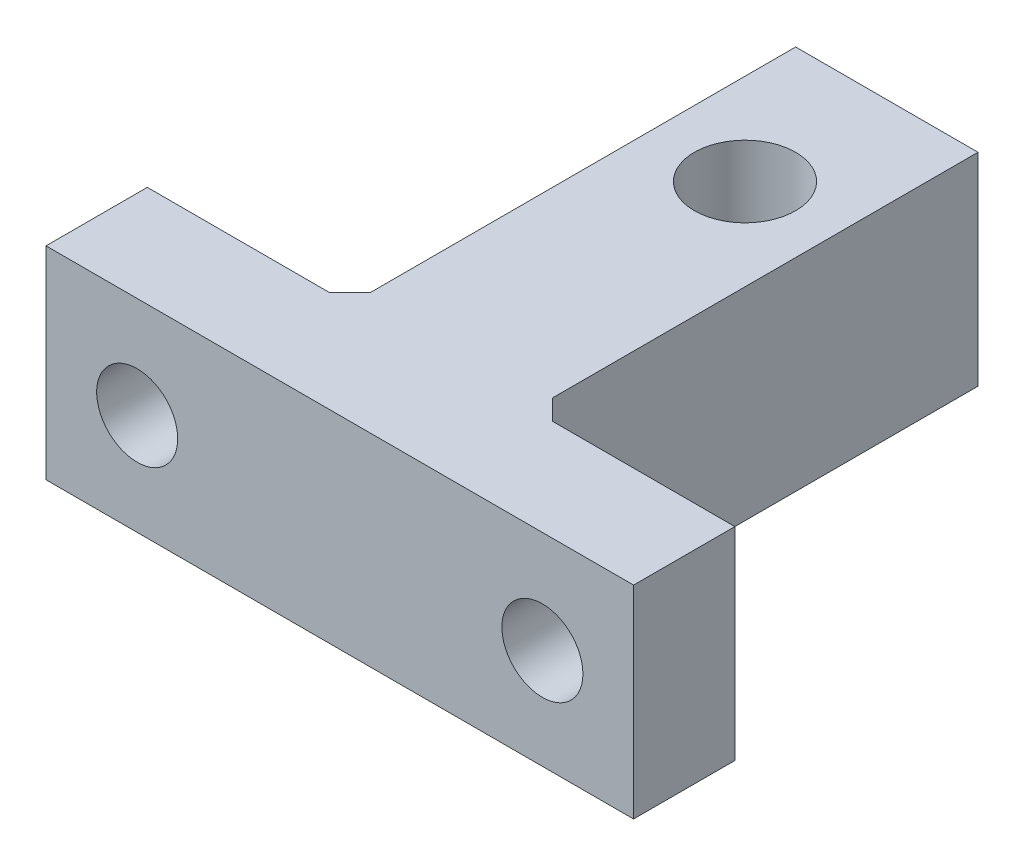
ISO-10303-21;
HEADER;
FILE_DESCRIPTION(('STEP AP214'),'2;1');
FILE_NAME('part.step','',(''),(''),'','','');
FILE_SCHEMA(('AUTOMOTIVE_DESIGN { 1 0 10303 214 1 1 1 1 }'));
ENDSEC;
DATA;
#1=APPLICATION_CONTEXT('core data for automotive mechanical design processes');
#2=APPLICATION_PROTOCOL_DEFINITION('international standard','automotive_design',2000,#1);
#3=PRODUCT_CONTEXT('',#1,'mechanical');
#4=PRODUCT('Part','Part','',(#3));
#5=PRODUCT_RELATED_PRODUCT_CATEGORY('part','',(#4));
#6=PRODUCT_DEFINITION_FORMATION('','',#4);
#7=PRODUCT_DEFINITION_CONTEXT('part definition',#1,'design');
#8=PRODUCT_DEFINITION('design','',#6,#7);
#9=PRODUCT_DEFINITION_SHAPE('','',#8);
#10=(LENGTH_UNIT() NAMED_UNIT(*) SI_UNIT(.MILLI.,.METRE.));
#11=(NAMED_UNIT(*) PLANE_ANGLE_UNIT() SI_UNIT($,.RADIAN.));
#12=(NAMED_UNIT(*) SI_UNIT($,.STERADIAN.) SOLID_ANGLE_UNIT());
#13=UNCERTAINTY_MEASURE_WITH_UNIT(LENGTH_MEASURE(1.E-05),#10,'distance_accuracy_value','');
#14=(GEOMETRIC_REPRESENTATION_CONTEXT(3) GLOBAL_UNCERTAINTY_ASSIGNED_CONTEXT((#13)) GLOBAL_UNIT_ASSIGNED_CONTEXT((#10,
#11,#12)) REPRESENTATION_CONTEXT('',''));
#15=CARTESIAN_POINT('',(0.,0.,0.));
#16=DIRECTION('',(0.,0.,1.));
#17=DIRECTION('',(1.,0.,0.));
#18=AXIS2_PLACEMENT_3D('',#15,#16,#17);
#19=CARTESIAN_POINT('',(0.,10.,0.));
#20=DIRECTION('',(0.,-1.,0.));
#21=DIRECTION('',(0.,0.,-1.));
#22=AXIS2_PLACEMENT_3D('',#19,#20,#21);
#23=PLANE('',#22);
#24=DIRECTION('',(1.,0.,0.));
#25=VECTOR('',#24,1.);
#26=CARTESIAN_POINT('',(12.9224089635854,10.,0.));
#27=LINE('',#26,#25);
#28=CARTESIAN_POINT('',(-16.0775910364146,10.,0.));
#29=VERTEX_POINT('',#28);
#30=CARTESIAN_POINT('',(12.9224089635854,10.,0.));
#31=VERTEX_POINT('',#30);
#32=EDGE_CURVE('E134',#29,#31,#27,.T.);
#33=ORIENTED_EDGE('',*,*,#32,.T.);
#34=DIRECTION('',(0.,0.,-1.));
#35=VECTOR('',#34,1.);
#36=CARTESIAN_POINT('',(12.9224089635854,10.,-5.));
#37=LINE('',#36,#35);
#38=CARTESIAN_POINT('',(12.9224089635854,10.,-5.));
#39=VERTEX_POINT('',#38);
#40=EDGE_CURVE('E124',#31,#39,#37,.T.);
#41=ORIENTED_EDGE('',*,*,#40,.T.);
#42=DIRECTION('',(-1.,0.,0.));
#43=VECTOR('',#42,1.);
#44=CARTESIAN_POINT('',(2.92240896358542,10.,-5.));
#45=LINE('',#44,#43);
#46=CARTESIAN_POINT('',(3.92240896358541,10.,-5.));
#47=VERTEX_POINT('',#46);
#48=EDGE_CURVE('E133',#39,#47,#45,.T.);
#49=ORIENTED_EDGE('',*,*,#48,.T.);
#50=DIRECTION('',(0.707106781186544,0.,0.707106781186552));
#51=VECTOR('',#50,1.);
#52=CARTESIAN_POINT('',(4.46120448179273,10.,-4.46120448179268));
#53=LINE('',#52,#51);
#54=CARTESIAN_POINT('',(2.92240896358542,10.,-6.00000000000001));
#55=VERTEX_POINT('',#54);
#56=EDGE_CURVE('E11',#47,#55,#53,.F.);
#57=ORIENTED_EDGE('',*,*,#56,.T.);
#58=DIRECTION('',(0.,0.,-1.));
#59=VECTOR('',#58,1.);
#60=CARTESIAN_POINT('',(2.92240896358542,10.,-27.));
#61=LINE('',#60,#59);
#62=CARTESIAN_POINT('',(2.92240896358542,10.,-27.));
#63=VERTEX_POINT('',#62);
#64=EDGE_CURVE('E251',#55,#63,#61,.T.);
#65=ORIENTED_EDGE('',*,*,#64,.T.);
#66=DIRECTION('',(-1.,0.,0.));
#67=VECTOR('',#66,1.);
#68=CARTESIAN_POINT('',(-6.07759103641458,10.,-27.));
#69=LINE('',#68,#67);
#70=CARTESIAN_POINT('',(-6.07759103641458,10.,-27.));
#71=VERTEX_POINT('',#70);
#72=EDGE_CURVE('E233',#63,#71,#69,.T.);
#73=ORIENTED_EDGE('',*,*,#72,.T.);
#74=DIRECTION('',(0.,0.,1.));
#75=VECTOR('',#74,1.);
#76=CARTESIAN_POINT('',(-6.07759103641458,10.,-5.));
#77=LINE('',#76,#75);
#78=CARTESIAN_POINT('',(-6.07759103641458,10.,-6.));
#79=VERTEX_POINT('',#78);
#80=EDGE_CURVE('E181',#71,#79,#77,.T.);
#81=ORIENTED_EDGE('',*,*,#80,.T.);
#82=DIRECTION('',(0.707106781186551,0.,-0.707106781186544));
#83=VECTOR('',#82,1.);
#84=CARTESIAN_POINT('',(-6.03879551820726,10.,-6.03879551820732));
#85=LINE('',#84,#83);
#86=CARTESIAN_POINT('',(-7.07759103641459,10.,-5.));
#87=VERTEX_POINT('',#86);
#88=EDGE_CURVE('E172',#79,#87,#85,.F.);
#89=ORIENTED_EDGE('',*,*,#88,.T.);
#90=DIRECTION('',(-1.,0.,0.));
#91=VECTOR('',#90,1.);
#92=CARTESIAN_POINT('',(-16.0775910364146,10.,-5.));
#93=LINE('',#92,#91);
#94=CARTESIAN_POINT('',(-16.0775910364146,10.,-5.));
#95=VERTEX_POINT('',#94);
#96=EDGE_CURVE('E178',#87,#95,#93,.T.);
#97=ORIENTED_EDGE('',*,*,#96,.T.);
#98=DIRECTION('',(0.,0.,1.));
#99=VECTOR('',#98,1.);
#100=CARTESIAN_POINT('',(-16.0775910364146,10.,0.));
#101=LINE('',#100,#99);
#102=EDGE_CURVE('E139',#95,#29,#101,.T.);
#103=ORIENTED_EDGE('',*,*,#102,.T.);
#104=EDGE_LOOP('',(#33,#41,#49,#57,#65,#73,#81,#89,#97,#103));
#105=FACE_BOUND('',#104,.T.);
#106=CARTESIAN_POINT('',(-1.57759103641458,10.,-20.));
#107=DIRECTION('',(0.,1.,0.));
#108=DIRECTION('',(0.,0.,1.));
#109=AXIS2_PLACEMENT_3D('',#106,#107,#108);
#110=CIRCLE('',#109,2.5);
#111=CARTESIAN_POINT('',(-1.57759103641458,10.,-17.5));
#112=VERTEX_POINT('',#111);
#113=EDGE_CURVE('E244',#112,#112,#110,.T.);
#114=ORIENTED_EDGE('',*,*,#113,.F.);
#115=EDGE_LOOP('',(#114));
#116=FACE_BOUND('',#115,.T.);
#117=ADVANCED_FACE('F45',(#105,#116),#23,.F.);
#118=CARTESIAN_POINT('',(0.,0.,0.));
#119=DIRECTION('',(0.,-1.,0.));
#120=DIRECTION('',(0.,0.,-1.));
#121=AXIS2_PLACEMENT_3D('',#118,#119,#120);
#122=PLANE('',#121);
#123=DIRECTION('',(0.,0.,-1.));
#124=VECTOR('',#123,1.);
#125=CARTESIAN_POINT('',(12.9224089635854,0.,-5.));
#126=LINE('',#125,#124);
#127=CARTESIAN_POINT('',(12.9224089635854,0.,0.));
#128=VERTEX_POINT('',#127);
#129=CARTESIAN_POINT('',(12.9224089635854,0.,-5.));
#130=VERTEX_POINT('',#129);
#131=EDGE_CURVE('E239',#128,#130,#126,.T.);
#132=ORIENTED_EDGE('',*,*,#131,.F.);
#133=DIRECTION('',(1.,0.,0.));
#134=VECTOR('',#133,1.);
#135=CARTESIAN_POINT('',(-1.57759103641458,0.,0.));
#136=LINE('',#135,#134);
#137=CARTESIAN_POINT('',(-16.0775910364146,0.,0.));
#138=VERTEX_POINT('',#137);
#139=EDGE_CURVE('E144',#138,#128,#136,.T.);
#140=ORIENTED_EDGE('',*,*,#139,.F.);
#141=DIRECTION('',(0.,0.,1.));
#142=VECTOR('',#141,1.);
#143=CARTESIAN_POINT('',(-16.0775910364146,0.,0.));
#144=LINE('',#143,#142);
#145=CARTESIAN_POINT('',(-16.0775910364146,0.,-5.));
#146=VERTEX_POINT('',#145);
#147=EDGE_CURVE('E211',#146,#138,#144,.T.);
#148=ORIENTED_EDGE('',*,*,#147,.F.);
#149=DIRECTION('',(-1.,0.,0.));
#150=VECTOR('',#149,1.);
#151=CARTESIAN_POINT('',(-16.0775910364146,0.,-5.));
#152=LINE('',#151,#150);
#153=CARTESIAN_POINT('',(-7.07759103641459,0.,-5.));
#154=VERTEX_POINT('',#153);
#155=EDGE_CURVE('E200',#154,#146,#152,.T.);
#156=ORIENTED_EDGE('',*,*,#155,.F.);
#157=DIRECTION('',(-0.707106781186551,0.,0.707106781186544));
#158=VECTOR('',#157,1.);
#159=CARTESIAN_POINT('',(-7.07759103641459,0.,-5.));
#160=LINE('',#159,#158);
#161=CARTESIAN_POINT('',(-6.07759103641458,0.,-6.));
#162=VERTEX_POINT('',#161);
#163=EDGE_CURVE('E169',#154,#162,#160,.F.);
#164=ORIENTED_EDGE('',*,*,#163,.T.);
#165=DIRECTION('',(0.,0.,1.));
#166=VECTOR('',#165,1.);
#167=CARTESIAN_POINT('',(-6.07759103641458,0.,-5.));
#168=LINE('',#167,#166);
#169=CARTESIAN_POINT('',(-6.07759103641458,0.,-27.));
#170=VERTEX_POINT('',#169);
#171=EDGE_CURVE('E198',#170,#162,#168,.T.);
#172=ORIENTED_EDGE('',*,*,#171,.F.);
#173=DIRECTION('',(-1.,0.,0.));
#174=VECTOR('',#173,1.);
#175=CARTESIAN_POINT('',(-6.07759103641458,0.,-27.));
#176=LINE('',#175,#174);
#177=CARTESIAN_POINT('',(2.92240896358542,0.,-27.));
#178=VERTEX_POINT('',#177);
#179=EDGE_CURVE('E207',#178,#170,#176,.T.);
#180=ORIENTED_EDGE('',*,*,#179,.F.);
#181=DIRECTION('',(0.,0.,-1.));
#182=VECTOR('',#181,1.);
#183=CARTESIAN_POINT('',(2.92240896358542,0.,-27.));
#184=LINE('',#183,#182);
#185=CARTESIAN_POINT('',(2.92240896358542,0.,-6.00000000000001));
#186=VERTEX_POINT('',#185);
#187=EDGE_CURVE('E213',#186,#178,#184,.T.);
#188=ORIENTED_EDGE('',*,*,#187,.F.);
#189=DIRECTION('',(-0.707106781186544,0.,-0.707106781186552));
#190=VECTOR('',#189,1.);
#191=CARTESIAN_POINT('',(2.92240896358542,0.,-6.00000000000001));
#192=LINE('',#191,#190);
#193=CARTESIAN_POINT('',(3.92240896358541,0.,-5.));
#194=VERTEX_POINT('',#193);
#195=EDGE_CURVE('E55',#186,#194,#192,.F.);
#196=ORIENTED_EDGE('',*,*,#195,.T.);
#197=DIRECTION('',(-1.,0.,0.));
#198=VECTOR('',#197,1.);
#199=CARTESIAN_POINT('',(2.92240896358542,0.,-5.));
#200=LINE('',#199,#198);
#201=EDGE_CURVE('E237',#130,#194,#200,.T.);
#202=ORIENTED_EDGE('',*,*,#201,.F.);
#203=EDGE_LOOP('',(#132,#140,#148,#156,#164,#172,#180,#188,#196,#202));
#204=FACE_BOUND('',#203,.T.);
#205=CARTESIAN_POINT('',(-1.57759103641458,0.,-20.));
#206=DIRECTION('',(0.,1.,0.));
#207=DIRECTION('',(0.,0.,1.));
#208=AXIS2_PLACEMENT_3D('',#205,#206,#207);
#209=CIRCLE('',#208,2.5);
#210=CARTESIAN_POINT('',(-1.57759103641458,0.,-17.5));
#211=VERTEX_POINT('',#210);
#212=EDGE_CURVE('E256',#211,#211,#209,.T.);
#213=ORIENTED_EDGE('',*,*,#212,.T.);
#214=EDGE_LOOP('',(#213));
#215=FACE_BOUND('',#214,.T.);
#216=ADVANCED_FACE('F195',(#204,#215),#122,.T.);
#217=CARTESIAN_POINT('',(12.9224089635854,10.,-5.));
#218=DIRECTION('',(-1.,0.,0.));
#219=DIRECTION('',(0.,0.,1.));
#220=AXIS2_PLACEMENT_3D('',#217,#218,#219);
#221=PLANE('',#220);
#222=ORIENTED_EDGE('',*,*,#131,.T.);
#223=DIRECTION('',(0.,-1.,0.));
#224=VECTOR('',#223,1.);
#225=CARTESIAN_POINT('',(12.9224089635854,10.,-5.));
#226=LINE('',#225,#224);
#227=EDGE_CURVE('E130',#39,#130,#226,.T.);
#228=ORIENTED_EDGE('',*,*,#227,.F.);
#229=ORIENTED_EDGE('',*,*,#40,.F.);
#230=DIRECTION('',(0.,-1.,0.));
#231=VECTOR('',#230,1.);
#232=CARTESIAN_POINT('',(12.9224089635854,10.,0.));
#233=LINE('',#232,#231);
#234=EDGE_CURVE('E128',#31,#128,#233,.T.);
#235=ORIENTED_EDGE('',*,*,#234,.T.);
#236=EDGE_LOOP('',(#222,#228,#229,#235));
#237=FACE_BOUND('',#236,.T.);
#238=ADVANCED_FACE('F126',(#237),#221,.F.);
#239=CARTESIAN_POINT('',(2.92240896358542,10.,-5.));
#240=DIRECTION('',(0.,0.,1.));
#241=DIRECTION('',(1.,0.,0.));
#242=AXIS2_PLACEMENT_3D('',#239,#240,#241);
#243=PLANE('',#242);
#244=CARTESIAN_POINT('',(8.42240896358542,4.95034220003328,-5.));
#245=DIRECTION('',(0.,0.,1.));
#246=DIRECTION('',(1.,0.,0.));
#247=AXIS2_PLACEMENT_3D('',#244,#245,#246);
#248=CIRCLE('',#247,2.);
#249=CARTESIAN_POINT('',(10.4224089635854,4.95034220003328,-5.));
#250=VERTEX_POINT('',#249);
#251=EDGE_CURVE('E267',#250,#250,#248,.T.);
#252=ORIENTED_EDGE('',*,*,#251,.T.);
#253=EDGE_LOOP('',(#252));
#254=FACE_BOUND('',#253,.T.);
#255=ORIENTED_EDGE('',*,*,#201,.T.);
#256=DIRECTION('',(0.,1.,0.));
#257=VECTOR('',#256,1.);
#258=CARTESIAN_POINT('',(3.92240896358541,10.,-5.));
#259=LINE('',#258,#257);
#260=EDGE_CURVE('E62',#194,#47,#259,.T.);
#261=ORIENTED_EDGE('',*,*,#260,.T.);
#262=ORIENTED_EDGE('',*,*,#48,.F.);
#263=ORIENTED_EDGE('',*,*,#227,.T.);
#264=EDGE_LOOP('',(#255,#261,#262,#263));
#265=FACE_BOUND('',#264,.T.);
#266=ADVANCED_FACE('F305',(#254,#265),#243,.F.);
#267=CARTESIAN_POINT('',(2.92240896358542,10.,-27.));
#268=DIRECTION('',(-1.,0.,0.));
#269=DIRECTION('',(0.,0.,1.));
#270=AXIS2_PLACEMENT_3D('',#267,#268,#269);
#271=PLANE('',#270);
#272=ORIENTED_EDGE('',*,*,#64,.F.);
#273=DIRECTION('',(0.,-1.,0.));
#274=VECTOR('',#273,1.);
#275=CARTESIAN_POINT('',(2.92240896358542,0.,-6.00000000000001));
#276=LINE('',#275,#274);
#277=EDGE_CURVE('E163',#55,#186,#276,.T.);
#278=ORIENTED_EDGE('',*,*,#277,.T.);
#279=ORIENTED_EDGE('',*,*,#187,.T.);
#280=DIRECTION('',(0.,-1.,0.));
#281=VECTOR('',#280,1.);
#282=CARTESIAN_POINT('',(2.92240896358542,10.,-27.));
#283=LINE('',#282,#281);
#284=EDGE_CURVE('E157',#63,#178,#283,.T.);
#285=ORIENTED_EDGE('',*,*,#284,.F.);
#286=EDGE_LOOP('',(#272,#278,#279,#285));
#287=FACE_BOUND('',#286,.T.);
#288=ADVANCED_FACE('F298',(#287),#271,.F.);
#289=CARTESIAN_POINT('',(-6.07759103641458,10.,-27.));
#290=DIRECTION('',(0.,0.,1.));
#291=DIRECTION('',(1.,0.,0.));
#292=AXIS2_PLACEMENT_3D('',#289,#290,#291);
#293=PLANE('',#292);
#294=CARTESIAN_POINT('',(-1.57759103641458,5.,-27.));
#295=DIRECTION('',(0.,0.,-1.));
#296=DIRECTION('',(-1.,0.,0.));
#297=AXIS2_PLACEMENT_3D('',#294,#295,#296);
#298=CIRCLE('',#297,1.5);
#299=CARTESIAN_POINT('',(-3.07759103641458,5.,-27.));
#300=VERTEX_POINT('',#299);
#301=EDGE_CURVE('E280',#300,#300,#298,.T.);
#302=ORIENTED_EDGE('',*,*,#301,.F.);
#303=EDGE_LOOP('',(#302));
#304=FACE_BOUND('',#303,.T.);
#305=ORIENTED_EDGE('',*,*,#179,.T.);
#306=DIRECTION('',(0.,-1.,0.));
#307=VECTOR('',#306,1.);
#308=CARTESIAN_POINT('',(-6.07759103641458,10.,-27.));
#309=LINE('',#308,#307);
#310=EDGE_CURVE('E205',#71,#170,#309,.T.);
#311=ORIENTED_EDGE('',*,*,#310,.F.);
#312=ORIENTED_EDGE('',*,*,#72,.F.);
#313=ORIENTED_EDGE('',*,*,#284,.T.);
#314=EDGE_LOOP('',(#305,#311,#312,#313));
#315=FACE_BOUND('',#314,.T.);
#316=ADVANCED_FACE('F232',(#304,#315),#293,.F.);
#317=CARTESIAN_POINT('',(-6.07759103641458,10.,-5.));
#318=DIRECTION('',(1.,0.,0.));
#319=DIRECTION('',(0.,0.,-1.));
#320=AXIS2_PLACEMENT_3D('',#317,#318,#319);
#321=PLANE('',#320);
#322=ORIENTED_EDGE('',*,*,#171,.T.);
#323=DIRECTION('',(0.,1.,0.));
#324=VECTOR('',#323,1.);
#325=CARTESIAN_POINT('',(-6.07759103641458,10.,-6.));
#326=LINE('',#325,#324);
#327=EDGE_CURVE('E155',#162,#79,#326,.T.);
#328=ORIENTED_EDGE('',*,*,#327,.T.);
#329=ORIENTED_EDGE('',*,*,#80,.F.);
#330=ORIENTED_EDGE('',*,*,#310,.T.);
#331=EDGE_LOOP('',(#322,#328,#329,#330));
#332=FACE_BOUND('',#331,.T.);
#333=ADVANCED_FACE('F203',(#332),#321,.F.);
#334=CARTESIAN_POINT('',(-16.0775910364146,10.,-5.));
#335=DIRECTION('',(0.,0.,1.));
#336=DIRECTION('',(1.,0.,0.));
#337=AXIS2_PLACEMENT_3D('',#334,#335,#336);
#338=PLANE('',#337);
#339=CARTESIAN_POINT('',(-11.5775910364146,5.,-5.));
#340=DIRECTION('',(0.,0.,1.));
#341=DIRECTION('',(1.,0.,0.));
#342=AXIS2_PLACEMENT_3D('',#339,#340,#341);
#343=CIRCLE('',#342,2.);
#344=CARTESIAN_POINT('',(-9.57759103641458,5.,-5.));
#345=VERTEX_POINT('',#344);
#346=EDGE_CURVE('E260',#345,#345,#343,.T.);
#347=ORIENTED_EDGE('',*,*,#346,.T.);
#348=EDGE_LOOP('',(#347));
#349=FACE_BOUND('',#348,.T.);
#350=ORIENTED_EDGE('',*,*,#96,.F.);
#351=DIRECTION('',(0.,-1.,0.));
#352=VECTOR('',#351,1.);
#353=CARTESIAN_POINT('',(-7.07759103641459,0.,-5.));
#354=LINE('',#353,#352);
#355=EDGE_CURVE('E150',#87,#154,#354,.T.);
#356=ORIENTED_EDGE('',*,*,#355,.T.);
#357=ORIENTED_EDGE('',*,*,#155,.T.);
#358=DIRECTION('',(0.,-1.,0.));
#359=VECTOR('',#358,1.);
#360=CARTESIAN_POINT('',(-16.0775910364146,10.,-5.));
#361=LINE('',#360,#359);
#362=EDGE_CURVE('E189',#95,#146,#361,.T.);
#363=ORIENTED_EDGE('',*,*,#362,.F.);
#364=EDGE_LOOP('',(#350,#356,#357,#363));
#365=FACE_BOUND('',#364,.T.);
#366=ADVANCED_FACE('F186',(#349,#365),#338,.F.);
#367=CARTESIAN_POINT('',(-16.0775910364146,10.,0.));
#368=DIRECTION('',(1.,0.,0.));
#369=DIRECTION('',(0.,0.,-1.));
#370=AXIS2_PLACEMENT_3D('',#367,#368,#369);
#371=PLANE('',#370);
#372=ORIENTED_EDGE('',*,*,#147,.T.);
#373=DIRECTION('',(0.,-1.,0.));
#374=VECTOR('',#373,1.);
#375=CARTESIAN_POINT('',(-16.0775910364146,10.,0.));
#376=LINE('',#375,#374);
#377=EDGE_CURVE('E221',#29,#138,#376,.T.);
#378=ORIENTED_EDGE('',*,*,#377,.F.);
#379=ORIENTED_EDGE('',*,*,#102,.F.);
#380=ORIENTED_EDGE('',*,*,#362,.T.);
#381=EDGE_LOOP('',(#372,#378,#379,#380));
#382=FACE_BOUND('',#381,.T.);
#383=ADVANCED_FACE('F319',(#382),#371,.F.);
#384=CARTESIAN_POINT('',(-1.57759103641458,10.,0.));
#385=DIRECTION('',(0.,0.,-1.));
#386=DIRECTION('',(-1.,0.,0.));
#387=AXIS2_PLACEMENT_3D('',#384,#385,#386);
#388=PLANE('',#387);
#389=CARTESIAN_POINT('',(-11.5775910364146,5.,0.));
#390=DIRECTION('',(0.,0.,1.));
#391=DIRECTION('',(1.,0.,0.));
#392=AXIS2_PLACEMENT_3D('',#389,#390,#391);
#393=CIRCLE('',#392,2.);
#394=CARTESIAN_POINT('',(-9.57759103641458,5.,0.));
#395=VERTEX_POINT('',#394);
#396=EDGE_CURVE('E271',#395,#395,#393,.T.);
#397=ORIENTED_EDGE('',*,*,#396,.F.);
#398=EDGE_LOOP('',(#397));
#399=FACE_BOUND('',#398,.T.);
#400=CARTESIAN_POINT('',(8.42240896358542,4.95034220003328,0.));
#401=DIRECTION('',(0.,0.,1.));
#402=DIRECTION('',(1.,0.,0.));
#403=AXIS2_PLACEMENT_3D('',#400,#401,#402);
#404=CIRCLE('',#403,2.);
#405=CARTESIAN_POINT('',(10.4224089635854,4.95034220003328,0.));
#406=VERTEX_POINT('',#405);
#407=EDGE_CURVE('E272',#406,#406,#404,.T.);
#408=ORIENTED_EDGE('',*,*,#407,.F.);
#409=EDGE_LOOP('',(#408));
#410=FACE_BOUND('',#409,.T.);
#411=ORIENTED_EDGE('',*,*,#139,.T.);
#412=ORIENTED_EDGE('',*,*,#234,.F.);
#413=ORIENTED_EDGE('',*,*,#32,.F.);
#414=ORIENTED_EDGE('',*,*,#377,.T.);
#415=EDGE_LOOP('',(#411,#412,#413,#414));
#416=FACE_BOUND('',#415,.T.);
#417=ADVANCED_FACE('F146',(#399,#410,#416),#388,.F.);
#418=CARTESIAN_POINT('',(-1.57759103641458,10.,-20.));
#419=DIRECTION('',(0.,-1.,0.));
#420=DIRECTION('',(0.,0.,-1.));
#421=AXIS2_PLACEMENT_3D('',#418,#419,#420);
#422=CYLINDRICAL_SURFACE('',#421,2.5);
#423=ORIENTED_EDGE('',*,*,#113,.T.);
#424=EDGE_LOOP('',(#423));
#425=FACE_BOUND('',#424,.T.);
#426=ORIENTED_EDGE('',*,*,#212,.F.);
#427=EDGE_LOOP('',(#426));
#428=FACE_BOUND('',#427,.T.);
#429=ADVANCED_FACE('F314',(#425,#428),#422,.F.);
#430=CARTESIAN_POINT('',(8.42240896358542,4.95034220003328,-10.));
#431=DIRECTION('',(0.,0.,1.));
#432=DIRECTION('',(1.,0.,0.));
#433=AXIS2_PLACEMENT_3D('',#430,#431,#432);
#434=CYLINDRICAL_SURFACE('',#433,2.);
#435=ORIENTED_EDGE('',*,*,#407,.T.);
#436=EDGE_LOOP('',(#435));
#437=FACE_BOUND('',#436,.T.);
#438=ORIENTED_EDGE('',*,*,#251,.F.);
#439=EDGE_LOOP('',(#438));
#440=FACE_BOUND('',#439,.T.);
#441=ADVANCED_FACE('F331',(#437,#440),#434,.F.);
#442=CARTESIAN_POINT('',(-11.5775910364146,5.,-10.));
#443=DIRECTION('',(0.,0.,1.));
#444=DIRECTION('',(1.,0.,0.));
#445=AXIS2_PLACEMENT_3D('',#442,#443,#444);
#446=CYLINDRICAL_SURFACE('',#445,2.);
#447=ORIENTED_EDGE('',*,*,#396,.T.);
#448=EDGE_LOOP('',(#447));
#449=FACE_BOUND('',#448,.T.);
#450=ORIENTED_EDGE('',*,*,#346,.F.);
#451=EDGE_LOOP('',(#450));
#452=FACE_BOUND('',#451,.T.);
#453=ADVANCED_FACE('F293',(#449,#452),#446,.F.);
#454=CARTESIAN_POINT('',(-1.57759103641458,5.,-23.));
#455=DIRECTION('',(0.,0.,-1.));
#456=DIRECTION('',(-1.,0.,0.));
#457=AXIS2_PLACEMENT_3D('',#454,#455,#456);
#458=CYLINDRICAL_SURFACE('',#457,1.5);
#459=CARTESIAN_POINT('',(-1.57759103641458,5.,-23.));
#460=DIRECTION('',(0.,0.,-1.));
#461=DIRECTION('',(-1.,0.,0.));
#462=AXIS2_PLACEMENT_3D('',#459,#460,#461);
#463=CIRCLE('',#462,1.5);
#464=CARTESIAN_POINT('',(-3.07759103641458,5.,-23.));
#465=VERTEX_POINT('',#464);
#466=EDGE_CURVE('E276',#465,#465,#463,.T.);
#467=ORIENTED_EDGE('',*,*,#466,.F.);
#468=EDGE_LOOP('',(#467));
#469=FACE_BOUND('',#468,.T.);
#470=ORIENTED_EDGE('',*,*,#301,.T.);
#471=EDGE_LOOP('',(#470));
#472=FACE_BOUND('',#471,.T.);
#473=ADVANCED_FACE('F290',(#469,#472),#458,.F.);
#474=CARTESIAN_POINT('',(-1.57759103641458,5.,-23.));
#475=DIRECTION('',(0.,0.,-1.));
#476=DIRECTION('',(-1.,0.,0.));
#477=AXIS2_PLACEMENT_3D('',#474,#475,#476);
#478=PLANE('',#477);
#479=ORIENTED_EDGE('',*,*,#466,.T.);
#480=EDGE_LOOP('',(#479));
#481=FACE_BOUND('',#480,.T.);
#482=ADVANCED_FACE('F288',(#481),#478,.T.);
#483=CARTESIAN_POINT('',(-7.07759103641459,10.,-5.));
#484=DIRECTION('',(-0.707106781186544,0.,-0.707106781186551));
#485=DIRECTION('',(0.,1.,0.));
#486=AXIS2_PLACEMENT_3D('',#483,#484,#485);
#487=PLANE('',#486);
#488=ORIENTED_EDGE('',*,*,#88,.F.);
#489=ORIENTED_EDGE('',*,*,#327,.F.);
#490=ORIENTED_EDGE('',*,*,#163,.F.);
#491=ORIENTED_EDGE('',*,*,#355,.F.);
#492=EDGE_LOOP('',(#488,#489,#490,#491));
#493=FACE_BOUND('',#492,.T.);
#494=ADVANCED_FACE('F192',(#493),#487,.T.);
#495=CARTESIAN_POINT('',(2.92240896358542,10.,-6.00000000000001));
#496=DIRECTION('',(0.707106781186552,0.,-0.707106781186544));
#497=DIRECTION('',(0.,1.,0.));
#498=AXIS2_PLACEMENT_3D('',#495,#496,#497);
#499=PLANE('',#498);
#500=ORIENTED_EDGE('',*,*,#56,.F.);
#501=ORIENTED_EDGE('',*,*,#260,.F.);
#502=ORIENTED_EDGE('',*,*,#195,.F.);
#503=ORIENTED_EDGE('',*,*,#277,.F.);
#504=EDGE_LOOP('',(#500,#501,#502,#503));
#505=FACE_BOUND('',#504,.T.);
#506=ADVANCED_FACE('F48',(#505),#499,.T.);
#507=CLOSED_SHELL('',(#117,#216,#238,#266,#288,#316,#333,#366,#383,#417,#429,#441,#453,#473,
#482,#494,#506));
#508=MANIFOLD_SOLID_BREP('B2',#507);
#509=ADVANCED_BREP_SHAPE_REPRESENTATION('',(#18,#508),#14);
#510=SHAPE_DEFINITION_REPRESENTATION(#9,#509);
ENDSEC;
END-ISO-10303-21;
